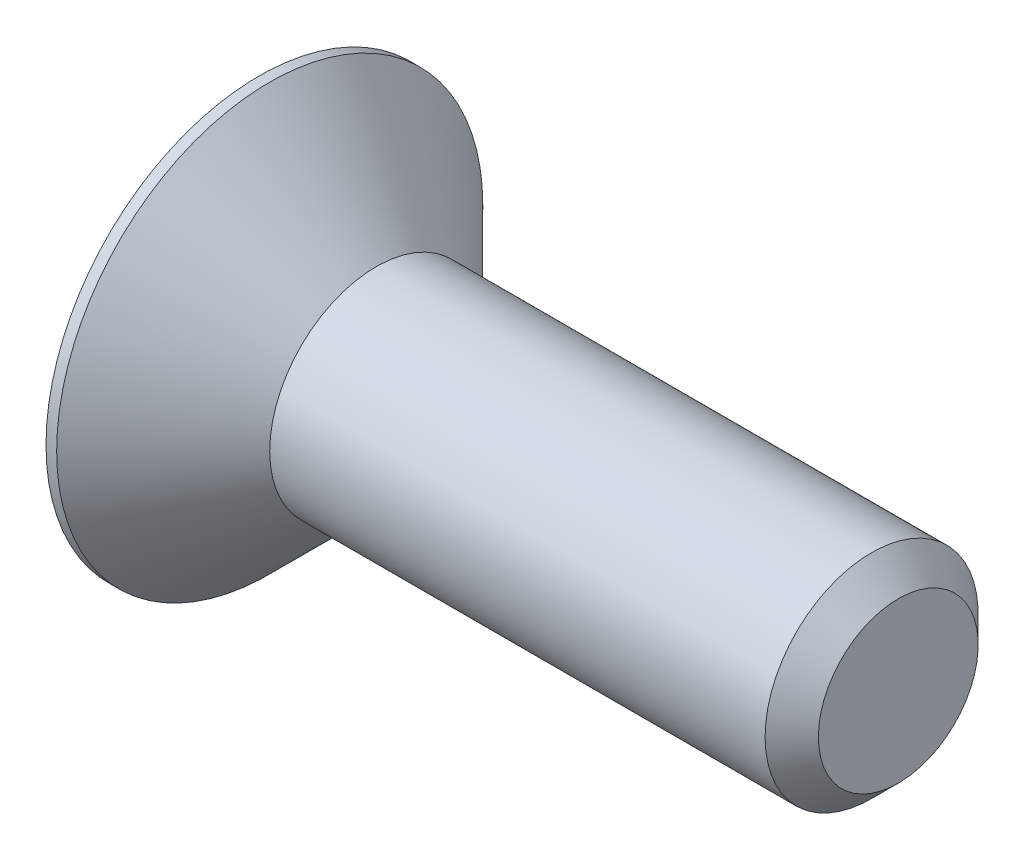
ISO-10303-21;
HEADER;
FILE_DESCRIPTION(('STEP AP214'),'2;1');
FILE_NAME('part.step','',(''),(''),'','','');
FILE_SCHEMA(('AUTOMOTIVE_DESIGN { 1 0 10303 214 1 1 1 1 }'));
ENDSEC;
DATA;
#1=APPLICATION_CONTEXT('core data for automotive mechanical design processes');
#2=APPLICATION_PROTOCOL_DEFINITION('international standard','automotive_design',2000,#1);
#3=PRODUCT_CONTEXT('',#1,'mechanical');
#4=PRODUCT('Part','Part','',(#3));
#5=PRODUCT_RELATED_PRODUCT_CATEGORY('part','',(#4));
#6=PRODUCT_DEFINITION_FORMATION('','',#4);
#7=PRODUCT_DEFINITION_CONTEXT('part definition',#1,'design');
#8=PRODUCT_DEFINITION('design','',#6,#7);
#9=PRODUCT_DEFINITION_SHAPE('','',#8);
#10=(LENGTH_UNIT() NAMED_UNIT(*) SI_UNIT(.MILLI.,.METRE.));
#11=(NAMED_UNIT(*) PLANE_ANGLE_UNIT() SI_UNIT($,.RADIAN.));
#12=(NAMED_UNIT(*) SI_UNIT($,.STERADIAN.) SOLID_ANGLE_UNIT());
#13=UNCERTAINTY_MEASURE_WITH_UNIT(LENGTH_MEASURE(1.E-05),#10,'distance_accuracy_value','');
#14=(GEOMETRIC_REPRESENTATION_CONTEXT(3) GLOBAL_UNCERTAINTY_ASSIGNED_CONTEXT((#13)) GLOBAL_UNIT_ASSIGNED_CONTEXT((#10,
#11,#12)) REPRESENTATION_CONTEXT('',''));
#15=CARTESIAN_POINT('',(0.,0.,0.));
#16=DIRECTION('',(0.,0.,1.));
#17=DIRECTION('',(1.,0.,0.));
#18=AXIS2_PLACEMENT_3D('',#15,#16,#17);
#19=CARTESIAN_POINT('',(0.,0.,0.));
#20=DIRECTION('',(1.,0.,0.));
#21=DIRECTION('',(0.,0.,-1.));
#22=AXIS2_PLACEMENT_3D('',#19,#20,#21);
#23=PLANE('',#22);
#24=DIRECTION('',(0.,0.866025403784439,0.5));
#25=VECTOR('',#24,1.);
#26=CARTESIAN_POINT('',(0.,-0.75,0.433012701892219));
#27=LINE('',#26,#25);
#28=CARTESIAN_POINT('',(0.,-0.75,0.433012701892219));
#29=VERTEX_POINT('',#28);
#30=CARTESIAN_POINT('',(0.,0.,0.866025403784438));
#31=VERTEX_POINT('',#30);
#32=EDGE_CURVE('E124',#29,#31,#27,.T.);
#33=ORIENTED_EDGE('',*,*,#32,.F.);
#34=DIRECTION('',(0.,0.,1.));
#35=VECTOR('',#34,1.);
#36=CARTESIAN_POINT('',(0.,-0.75,-0.43301270189222));
#37=LINE('',#36,#35);
#38=CARTESIAN_POINT('',(0.,-0.75,-0.43301270189222));
#39=VERTEX_POINT('',#38);
#40=EDGE_CURVE('E50',#39,#29,#37,.T.);
#41=ORIENTED_EDGE('',*,*,#40,.F.);
#42=DIRECTION('',(0.,-0.866025403784439,0.5));
#43=VECTOR('',#42,1.);
#44=CARTESIAN_POINT('',(0.,0.,-0.866025403784439));
#45=LINE('',#44,#43);
#46=CARTESIAN_POINT('',(0.,0.,-0.866025403784439));
#47=VERTEX_POINT('',#46);
#48=EDGE_CURVE('E133',#47,#39,#45,.T.);
#49=ORIENTED_EDGE('',*,*,#48,.F.);
#50=DIRECTION('',(0.,-0.866025403784439,-0.5));
#51=VECTOR('',#50,1.);
#52=CARTESIAN_POINT('',(0.,0.75,-0.43301270189222));
#53=LINE('',#52,#51);
#54=CARTESIAN_POINT('',(0.,0.75,-0.43301270189222));
#55=VERTEX_POINT('',#54);
#56=EDGE_CURVE('E131',#55,#47,#53,.T.);
#57=ORIENTED_EDGE('',*,*,#56,.F.);
#58=DIRECTION('',(0.,0.,-1.));
#59=VECTOR('',#58,1.);
#60=CARTESIAN_POINT('',(0.,0.75,0.433012701892219));
#61=LINE('',#60,#59);
#62=CARTESIAN_POINT('',(0.,0.75,0.433012701892219));
#63=VERTEX_POINT('',#62);
#64=EDGE_CURVE('E98',#63,#55,#61,.T.);
#65=ORIENTED_EDGE('',*,*,#64,.F.);
#66=DIRECTION('',(0.,0.866025403784439,-0.5));
#67=VECTOR('',#66,1.);
#68=CARTESIAN_POINT('',(0.,0.,0.866025403784438));
#69=LINE('',#68,#67);
#70=EDGE_CURVE('E127',#31,#63,#69,.T.);
#71=ORIENTED_EDGE('',*,*,#70,.F.);
#72=EDGE_LOOP('',(#33,#41,#49,#57,#65,#71));
#73=FACE_BOUND('',#72,.T.);
#74=CARTESIAN_POINT('',(0.,0.,0.));
#75=DIRECTION('',(-1.,0.,0.));
#76=DIRECTION('',(0.,0.,1.));
#77=AXIS2_PLACEMENT_3D('',#74,#75,#76);
#78=CIRCLE('',#77,2.);
#79=CARTESIAN_POINT('',(0.,0.,2.));
#80=VERTEX_POINT('',#79);
#81=EDGE_CURVE('E11',#80,#80,#78,.T.);
#82=ORIENTED_EDGE('',*,*,#81,.T.);
#83=EDGE_LOOP('',(#82));
#84=FACE_BOUND('',#83,.T.);
#85=ADVANCED_FACE('F36',(#73,#84),#23,.F.);
#86=CARTESIAN_POINT('',(-2.28184155946539,0.,0.));
#87=DIRECTION('',(-1.,0.,0.));
#88=DIRECTION('',(0.,0.,1.));
#89=AXIS2_PLACEMENT_3D('',#86,#87,#88);
#90=CYLINDRICAL_SURFACE('',#89,2.);
#91=ORIENTED_EDGE('',*,*,#81,.F.);
#92=EDGE_LOOP('',(#91));
#93=FACE_BOUND('',#92,.T.);
#94=CARTESIAN_POINT('',(0.0999999999999998,0.,0.));
#95=DIRECTION('',(-1.,0.,0.));
#96=DIRECTION('',(0.,0.,1.));
#97=AXIS2_PLACEMENT_3D('',#94,#95,#96);
#98=CIRCLE('',#97,2.);
#99=CARTESIAN_POINT('',(0.0999999999999998,0.,2.));
#100=VERTEX_POINT('',#99);
#101=EDGE_CURVE('E43',#100,#100,#98,.T.);
#102=ORIENTED_EDGE('',*,*,#101,.T.);
#103=EDGE_LOOP('',(#102));
#104=FACE_BOUND('',#103,.T.);
#105=ADVANCED_FACE('F153',(#93,#104),#90,.T.);
#106=CARTESIAN_POINT('',(1.1,0.,0.));
#107=DIRECTION('',(-1.,0.,0.));
#108=DIRECTION('',(0.,0.,1.));
#109=AXIS2_PLACEMENT_3D('',#106,#107,#108);
#110=CONICAL_SURFACE('',#109,1.,0.78539816339745);
#111=ORIENTED_EDGE('',*,*,#101,.F.);
#112=EDGE_LOOP('',(#111));
#113=FACE_BOUND('',#112,.T.);
#114=CARTESIAN_POINT('',(1.1,0.,0.));
#115=DIRECTION('',(-1.,0.,0.));
#116=DIRECTION('',(0.,0.,1.));
#117=AXIS2_PLACEMENT_3D('',#114,#115,#116);
#118=CIRCLE('',#117,1.);
#119=CARTESIAN_POINT('',(1.1,0.,1.));
#120=VERTEX_POINT('',#119);
#121=EDGE_CURVE('E148',#120,#120,#118,.T.);
#122=ORIENTED_EDGE('',*,*,#121,.T.);
#123=EDGE_LOOP('',(#122));
#124=FACE_BOUND('',#123,.T.);
#125=ADVANCED_FACE('F155',(#113,#124),#110,.T.);
#126=CARTESIAN_POINT('',(-2.28184155946539,0.,0.));
#127=DIRECTION('',(-1.,0.,0.));
#128=DIRECTION('',(0.,0.,1.));
#129=AXIS2_PLACEMENT_3D('',#126,#127,#128);
#130=CYLINDRICAL_SURFACE('',#129,1.);
#131=ORIENTED_EDGE('',*,*,#121,.F.);
#132=EDGE_LOOP('',(#131));
#133=FACE_BOUND('',#132,.T.);
#134=CARTESIAN_POINT('',(5.75,0.,0.));
#135=DIRECTION('',(-1.,0.,0.));
#136=DIRECTION('',(0.,0.,1.));
#137=AXIS2_PLACEMENT_3D('',#134,#135,#136);
#138=CIRCLE('',#137,1.);
#139=CARTESIAN_POINT('',(5.75,0.,1.));
#140=VERTEX_POINT('',#139);
#141=EDGE_CURVE('E145',#140,#140,#138,.T.);
#142=ORIENTED_EDGE('',*,*,#141,.T.);
#143=EDGE_LOOP('',(#142));
#144=FACE_BOUND('',#143,.T.);
#145=ADVANCED_FACE('F158',(#133,#144),#130,.T.);
#146=CARTESIAN_POINT('',(6.,0.,0.));
#147=DIRECTION('',(-1.,0.,0.));
#148=DIRECTION('',(0.,0.,1.));
#149=AXIS2_PLACEMENT_3D('',#146,#147,#148);
#150=CONICAL_SURFACE('',#149,0.75,0.785398163397448);
#151=ORIENTED_EDGE('',*,*,#141,.F.);
#152=EDGE_LOOP('',(#151));
#153=FACE_BOUND('',#152,.T.);
#154=CARTESIAN_POINT('',(6.,0.,0.));
#155=DIRECTION('',(-1.,0.,0.));
#156=DIRECTION('',(0.,0.,1.));
#157=AXIS2_PLACEMENT_3D('',#154,#155,#156);
#158=CIRCLE('',#157,0.75);
#159=CARTESIAN_POINT('',(6.,0.,0.75));
#160=VERTEX_POINT('',#159);
#161=EDGE_CURVE('E137',#160,#160,#158,.T.);
#162=ORIENTED_EDGE('',*,*,#161,.T.);
#163=EDGE_LOOP('',(#162));
#164=FACE_BOUND('',#163,.T.);
#165=ADVANCED_FACE('F164',(#153,#164),#150,.T.);
#166=CARTESIAN_POINT('',(6.,0.75,0.));
#167=DIRECTION('',(-1.,0.,0.));
#168=DIRECTION('',(0.,0.,1.));
#169=AXIS2_PLACEMENT_3D('',#166,#167,#168);
#170=PLANE('',#169);
#171=ORIENTED_EDGE('',*,*,#161,.F.);
#172=EDGE_LOOP('',(#171));
#173=FACE_BOUND('',#172,.T.);
#174=ADVANCED_FACE('F170',(#173),#170,.F.);
#175=CARTESIAN_POINT('',(0.8,-0.75,-0.43301270189222));
#176=DIRECTION('',(0.,-1.,0.));
#177=DIRECTION('',(0.,0.,-1.));
#178=AXIS2_PLACEMENT_3D('',#175,#176,#177);
#179=PLANE('',#178);
#180=ORIENTED_EDGE('',*,*,#40,.T.);
#181=DIRECTION('',(-1.,0.,0.));
#182=VECTOR('',#181,1.);
#183=CARTESIAN_POINT('',(0.8,-0.75,0.433012701892219));
#184=LINE('',#183,#182);
#185=CARTESIAN_POINT('',(0.8,-0.75,0.433012701892219));
#186=VERTEX_POINT('',#185);
#187=EDGE_CURVE('E80',#186,#29,#184,.T.);
#188=ORIENTED_EDGE('',*,*,#187,.F.);
#189=DIRECTION('',(0.,0.,1.));
#190=VECTOR('',#189,1.);
#191=CARTESIAN_POINT('',(0.8,-0.75,-0.43301270189222));
#192=LINE('',#191,#190);
#193=CARTESIAN_POINT('',(0.8,-0.75,-0.43301270189222));
#194=VERTEX_POINT('',#193);
#195=EDGE_CURVE('E135',#194,#186,#192,.T.);
#196=ORIENTED_EDGE('',*,*,#195,.F.);
#197=DIRECTION('',(-1.,0.,0.));
#198=VECTOR('',#197,1.);
#199=CARTESIAN_POINT('',(0.8,-0.75,-0.43301270189222));
#200=LINE('',#199,#198);
#201=EDGE_CURVE('E58',#194,#39,#200,.T.);
#202=ORIENTED_EDGE('',*,*,#201,.T.);
#203=EDGE_LOOP('',(#180,#188,#196,#202));
#204=FACE_BOUND('',#203,.T.);
#205=ADVANCED_FACE('F175',(#204),#179,.F.);
#206=CARTESIAN_POINT('',(0.8,0.,-0.866025403784439));
#207=DIRECTION('',(0.,-0.5,-0.866025403784439));
#208=DIRECTION('',(0.,0.866025403784439,-0.5));
#209=AXIS2_PLACEMENT_3D('',#206,#207,#208);
#210=PLANE('',#209);
#211=ORIENTED_EDGE('',*,*,#48,.T.);
#212=ORIENTED_EDGE('',*,*,#201,.F.);
#213=DIRECTION('',(0.,-0.866025403784439,0.5));
#214=VECTOR('',#213,1.);
#215=CARTESIAN_POINT('',(0.8,0.,-0.866025403784439));
#216=LINE('',#215,#214);
#217=CARTESIAN_POINT('',(0.8,0.,-0.866025403784439));
#218=VERTEX_POINT('',#217);
#219=EDGE_CURVE('E110',#218,#194,#216,.T.);
#220=ORIENTED_EDGE('',*,*,#219,.F.);
#221=DIRECTION('',(-1.,0.,0.));
#222=VECTOR('',#221,1.);
#223=CARTESIAN_POINT('',(0.8,0.,-0.866025403784439));
#224=LINE('',#223,#222);
#225=EDGE_CURVE('E102',#218,#47,#224,.T.);
#226=ORIENTED_EDGE('',*,*,#225,.T.);
#227=EDGE_LOOP('',(#211,#212,#220,#226));
#228=FACE_BOUND('',#227,.T.);
#229=ADVANCED_FACE('F180',(#228),#210,.F.);
#230=CARTESIAN_POINT('',(0.8,0.75,-0.43301270189222));
#231=DIRECTION('',(0.,0.5,-0.866025403784439));
#232=DIRECTION('',(0.,0.866025403784439,0.5));
#233=AXIS2_PLACEMENT_3D('',#230,#231,#232);
#234=PLANE('',#233);
#235=ORIENTED_EDGE('',*,*,#56,.T.);
#236=ORIENTED_EDGE('',*,*,#225,.F.);
#237=DIRECTION('',(0.,-0.866025403784439,-0.5));
#238=VECTOR('',#237,1.);
#239=CARTESIAN_POINT('',(0.8,0.75,-0.43301270189222));
#240=LINE('',#239,#238);
#241=CARTESIAN_POINT('',(0.8,0.75,-0.43301270189222));
#242=VERTEX_POINT('',#241);
#243=EDGE_CURVE('E106',#242,#218,#240,.T.);
#244=ORIENTED_EDGE('',*,*,#243,.F.);
#245=DIRECTION('',(-1.,0.,0.));
#246=VECTOR('',#245,1.);
#247=CARTESIAN_POINT('',(0.8,0.75,-0.43301270189222));
#248=LINE('',#247,#246);
#249=EDGE_CURVE('E91',#242,#55,#248,.T.);
#250=ORIENTED_EDGE('',*,*,#249,.T.);
#251=EDGE_LOOP('',(#235,#236,#244,#250));
#252=FACE_BOUND('',#251,.T.);
#253=ADVANCED_FACE('F107',(#252),#234,.F.);
#254=CARTESIAN_POINT('',(0.8,0.75,0.433012701892219));
#255=DIRECTION('',(0.,1.,0.));
#256=DIRECTION('',(0.,0.,1.));
#257=AXIS2_PLACEMENT_3D('',#254,#255,#256);
#258=PLANE('',#257);
#259=ORIENTED_EDGE('',*,*,#64,.T.);
#260=ORIENTED_EDGE('',*,*,#249,.F.);
#261=DIRECTION('',(0.,0.,-1.));
#262=VECTOR('',#261,1.);
#263=CARTESIAN_POINT('',(0.8,0.75,0.433012701892219));
#264=LINE('',#263,#262);
#265=CARTESIAN_POINT('',(0.8,0.75,0.433012701892219));
#266=VERTEX_POINT('',#265);
#267=EDGE_CURVE('E95',#266,#242,#264,.T.);
#268=ORIENTED_EDGE('',*,*,#267,.F.);
#269=DIRECTION('',(-1.,0.,0.));
#270=VECTOR('',#269,1.);
#271=CARTESIAN_POINT('',(0.8,0.75,0.433012701892219));
#272=LINE('',#271,#270);
#273=EDGE_CURVE('E103',#266,#63,#272,.T.);
#274=ORIENTED_EDGE('',*,*,#273,.T.);
#275=EDGE_LOOP('',(#259,#260,#268,#274));
#276=FACE_BOUND('',#275,.T.);
#277=ADVANCED_FACE('F93',(#276),#258,.F.);
#278=CARTESIAN_POINT('',(0.8,0.,0.866025403784438));
#279=DIRECTION('',(0.,0.5,0.866025403784439));
#280=DIRECTION('',(0.,-0.866025403784439,0.5));
#281=AXIS2_PLACEMENT_3D('',#278,#279,#280);
#282=PLANE('',#281);
#283=ORIENTED_EDGE('',*,*,#70,.T.);
#284=ORIENTED_EDGE('',*,*,#273,.F.);
#285=DIRECTION('',(0.,0.866025403784439,-0.5));
#286=VECTOR('',#285,1.);
#287=CARTESIAN_POINT('',(0.8,0.,0.866025403784438));
#288=LINE('',#287,#286);
#289=CARTESIAN_POINT('',(0.8,0.,0.866025403784438));
#290=VERTEX_POINT('',#289);
#291=EDGE_CURVE('E116',#290,#266,#288,.T.);
#292=ORIENTED_EDGE('',*,*,#291,.F.);
#293=DIRECTION('',(-1.,0.,0.));
#294=VECTOR('',#293,1.);
#295=CARTESIAN_POINT('',(0.8,0.,0.866025403784438));
#296=LINE('',#295,#294);
#297=EDGE_CURVE('E140',#290,#31,#296,.T.);
#298=ORIENTED_EDGE('',*,*,#297,.T.);
#299=EDGE_LOOP('',(#283,#284,#292,#298));
#300=FACE_BOUND('',#299,.T.);
#301=ADVANCED_FACE('F206',(#300),#282,.F.);
#302=CARTESIAN_POINT('',(0.8,-0.75,0.433012701892219));
#303=DIRECTION('',(0.,-0.5,0.866025403784439));
#304=DIRECTION('',(0.,-0.866025403784439,-0.5));
#305=AXIS2_PLACEMENT_3D('',#302,#303,#304);
#306=PLANE('',#305);
#307=ORIENTED_EDGE('',*,*,#32,.T.);
#308=ORIENTED_EDGE('',*,*,#297,.F.);
#309=DIRECTION('',(0.,0.866025403784439,0.5));
#310=VECTOR('',#309,1.);
#311=CARTESIAN_POINT('',(0.8,-0.75,0.433012701892219));
#312=LINE('',#311,#310);
#313=EDGE_CURVE('E118',#186,#290,#312,.T.);
#314=ORIENTED_EDGE('',*,*,#313,.F.);
#315=ORIENTED_EDGE('',*,*,#187,.T.);
#316=EDGE_LOOP('',(#307,#308,#314,#315));
#317=FACE_BOUND('',#316,.T.);
#318=ADVANCED_FACE('F194',(#317),#306,.F.);
#319=CARTESIAN_POINT('',(0.8,0.,0.));
#320=DIRECTION('',(-1.,0.,0.));
#321=DIRECTION('',(0.,0.,1.));
#322=AXIS2_PLACEMENT_3D('',#319,#320,#321);
#323=PLANE('',#322);
#324=ORIENTED_EDGE('',*,*,#195,.T.);
#325=ORIENTED_EDGE('',*,*,#313,.T.);
#326=ORIENTED_EDGE('',*,*,#291,.T.);
#327=ORIENTED_EDGE('',*,*,#267,.T.);
#328=ORIENTED_EDGE('',*,*,#243,.T.);
#329=ORIENTED_EDGE('',*,*,#219,.T.);
#330=EDGE_LOOP('',(#324,#325,#326,#327,#328,#329));
#331=FACE_BOUND('',#330,.T.);
#332=ADVANCED_FACE('F113',(#331),#323,.T.);
#333=CLOSED_SHELL('',(#85,#105,#125,#145,#165,#174,#205,#229,#253,#277,#301,#318,#332));
#334=MANIFOLD_SOLID_BREP('B2',#333);
#335=ADVANCED_BREP_SHAPE_REPRESENTATION('',(#18,#334),#14);
#336=SHAPE_DEFINITION_REPRESENTATION(#9,#335);
ENDSEC;
END-ISO-10303-21;
